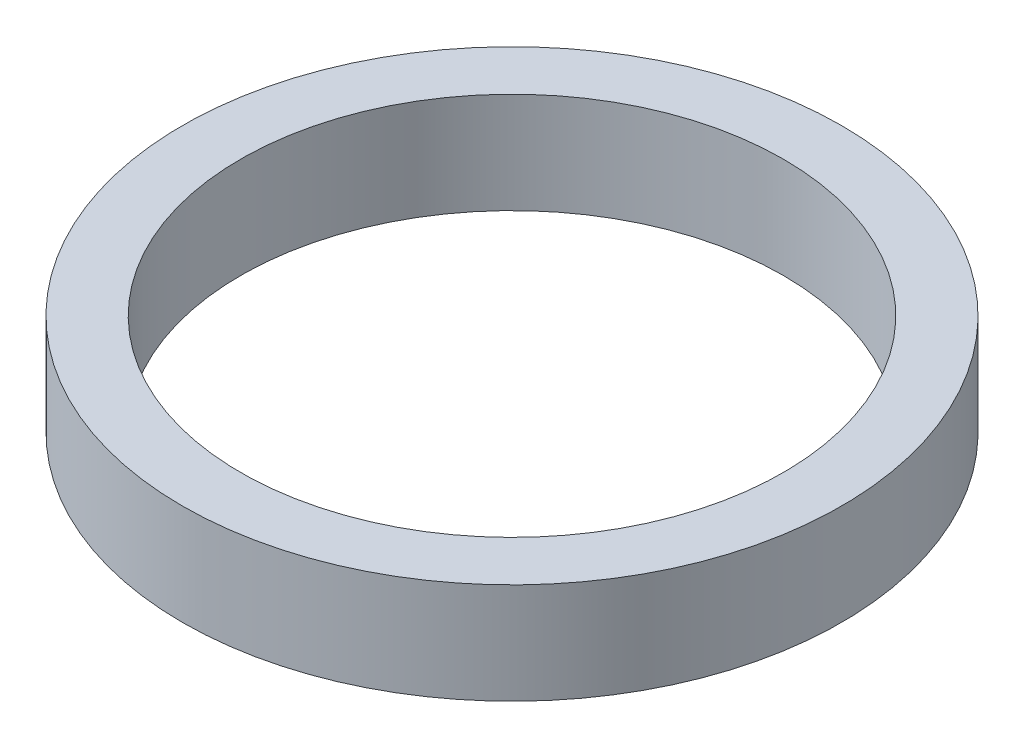
ISO-10303-21;
HEADER;
FILE_DESCRIPTION(('STEP AP214'),'2;1');
FILE_NAME('part.step','',(''),(''),'','','');
FILE_SCHEMA(('AUTOMOTIVE_DESIGN { 1 0 10303 214 1 1 1 1 }'));
ENDSEC;
DATA;
#1=APPLICATION_CONTEXT('core data for automotive mechanical design processes');
#2=APPLICATION_PROTOCOL_DEFINITION('international standard','automotive_design',2000,#1);
#3=PRODUCT_CONTEXT('',#1,'mechanical');
#4=PRODUCT('Part','Part','',(#3));
#5=PRODUCT_RELATED_PRODUCT_CATEGORY('part','',(#4));
#6=PRODUCT_DEFINITION_FORMATION('','',#4);
#7=PRODUCT_DEFINITION_CONTEXT('part definition',#1,'design');
#8=PRODUCT_DEFINITION('design','',#6,#7);
#9=PRODUCT_DEFINITION_SHAPE('','',#8);
#10=(LENGTH_UNIT() NAMED_UNIT(*) SI_UNIT(.MILLI.,.METRE.));
#11=(NAMED_UNIT(*) PLANE_ANGLE_UNIT() SI_UNIT($,.RADIAN.));
#12=(NAMED_UNIT(*) SI_UNIT($,.STERADIAN.) SOLID_ANGLE_UNIT());
#13=UNCERTAINTY_MEASURE_WITH_UNIT(LENGTH_MEASURE(1.E-05),#10,'distance_accuracy_value','');
#14=(GEOMETRIC_REPRESENTATION_CONTEXT(3) GLOBAL_UNCERTAINTY_ASSIGNED_CONTEXT((#13)) GLOBAL_UNIT_ASSIGNED_CONTEXT((#10,
#11,#12)) REPRESENTATION_CONTEXT('',''));
#15=CARTESIAN_POINT('',(0.,0.,0.));
#16=DIRECTION('',(0.,0.,1.));
#17=DIRECTION('',(1.,0.,0.));
#18=AXIS2_PLACEMENT_3D('',#15,#16,#17);
#19=CARTESIAN_POINT('',(0.,13.,0.));
#20=DIRECTION('',(0.,-1.,0.));
#21=DIRECTION('',(0.,0.,-1.));
#22=AXIS2_PLACEMENT_3D('',#19,#20,#21);
#23=CYLINDRICAL_SURFACE('',#22,42.5);
#24=CARTESIAN_POINT('',(0.,13.,0.));
#25=DIRECTION('',(0.,1.,0.));
#26=DIRECTION('',(0.,0.,1.));
#27=AXIS2_PLACEMENT_3D('',#24,#25,#26);
#28=CIRCLE('',#27,42.5);
#29=CARTESIAN_POINT('',(0.,13.,-42.5));
#30=VERTEX_POINT('',#29);
#31=EDGE_CURVE('E10',#30,#30,#28,.T.);
#32=CARTESIAN_POINT('',(0.,0.,0.));
#33=DIRECTION('',(0.,1.,0.));
#34=DIRECTION('',(0.,0.,1.));
#35=AXIS2_PLACEMENT_3D('',#32,#33,#34);
#36=CIRCLE('',#35,42.5);
#37=CARTESIAN_POINT('',(0.,0.,-42.5));
#38=VERTEX_POINT('',#37);
#39=EDGE_CURVE('E37',#38,#38,#36,.T.);
#40=CARTESIAN_POINT('',(0.,13.,-42.5));
#41=CARTESIAN_POINT('',(0.,12.8645833333333,-42.5));
#42=CARTESIAN_POINT('',(0.,12.7291666666667,-42.5));
#43=CARTESIAN_POINT('',(0.,12.4583333333333,-42.5));
#44=CARTESIAN_POINT('',(0.,12.3229166666667,-42.5));
#45=CARTESIAN_POINT('',(0.,12.0520833333333,-42.5));
#46=CARTESIAN_POINT('',(0.,11.9166666666667,-42.5));
#47=CARTESIAN_POINT('',(0.,11.6458333333333,-42.5));
#48=CARTESIAN_POINT('',(0.,11.5104166666667,-42.5));
#49=CARTESIAN_POINT('',(0.,11.2395833333333,-42.5));
#50=CARTESIAN_POINT('',(0.,11.1041666666667,-42.5));
#51=CARTESIAN_POINT('',(0.,10.8333333333333,-42.5));
#52=CARTESIAN_POINT('',(0.,10.6979166666667,-42.5));
#53=CARTESIAN_POINT('',(0.,10.4270833333333,-42.5));
#54=CARTESIAN_POINT('',(0.,10.2916666666667,-42.5));
#55=CARTESIAN_POINT('',(0.,10.0208333333333,-42.5));
#56=CARTESIAN_POINT('',(0.,9.88541666666667,-42.5));
#57=CARTESIAN_POINT('',(0.,9.61458333333333,-42.5));
#58=CARTESIAN_POINT('',(0.,9.47916666666667,-42.5));
#59=CARTESIAN_POINT('',(0.,9.20833333333333,-42.5));
#60=CARTESIAN_POINT('',(0.,9.07291666666666,-42.5));
#61=CARTESIAN_POINT('',(0.,8.80208333333333,-42.5));
#62=CARTESIAN_POINT('',(0.,8.66666666666667,-42.5));
#63=CARTESIAN_POINT('',(0.,8.39583333333333,-42.5));
#64=CARTESIAN_POINT('',(0.,8.26041666666667,-42.5));
#65=CARTESIAN_POINT('',(0.,7.98958333333333,-42.5));
#66=CARTESIAN_POINT('',(0.,7.85416666666667,-42.5));
#67=CARTESIAN_POINT('',(0.,7.58333333333333,-42.5));
#68=CARTESIAN_POINT('',(0.,7.44791666666667,-42.5));
#69=CARTESIAN_POINT('',(0.,7.17708333333333,-42.5));
#70=CARTESIAN_POINT('',(0.,7.04166666666667,-42.5));
#71=CARTESIAN_POINT('',(0.,6.77083333333333,-42.5));
#72=CARTESIAN_POINT('',(0.,6.63541666666667,-42.5));
#73=CARTESIAN_POINT('',(0.,6.36458333333333,-42.5));
#74=CARTESIAN_POINT('',(0.,6.22916666666667,-42.5));
#75=CARTESIAN_POINT('',(0.,5.95833333333333,-42.5));
#76=CARTESIAN_POINT('',(0.,5.82291666666667,-42.5));
#77=CARTESIAN_POINT('',(0.,5.55208333333333,-42.5));
#78=CARTESIAN_POINT('',(0.,5.41666666666667,-42.5));
#79=CARTESIAN_POINT('',(0.,5.14583333333333,-42.5));
#80=CARTESIAN_POINT('',(0.,5.01041666666667,-42.5));
#81=CARTESIAN_POINT('',(0.,4.73958333333333,-42.5));
#82=CARTESIAN_POINT('',(0.,4.60416666666667,-42.5));
#83=CARTESIAN_POINT('',(0.,4.33333333333333,-42.5));
#84=CARTESIAN_POINT('',(0.,4.19791666666667,-42.5));
#85=CARTESIAN_POINT('',(0.,3.92708333333333,-42.5));
#86=CARTESIAN_POINT('',(0.,3.79166666666667,-42.5));
#87=CARTESIAN_POINT('',(0.,3.52083333333333,-42.5));
#88=CARTESIAN_POINT('',(0.,3.38541666666667,-42.5));
#89=CARTESIAN_POINT('',(0.,3.11458333333333,-42.5));
#90=CARTESIAN_POINT('',(0.,2.97916666666667,-42.5));
#91=CARTESIAN_POINT('',(0.,2.70833333333333,-42.5));
#92=CARTESIAN_POINT('',(0.,2.57291666666667,-42.5));
#93=CARTESIAN_POINT('',(0.,2.30208333333333,-42.5));
#94=CARTESIAN_POINT('',(0.,2.16666666666667,-42.5));
#95=CARTESIAN_POINT('',(0.,1.89583333333333,-42.5));
#96=CARTESIAN_POINT('',(0.,1.76041666666667,-42.5));
#97=CARTESIAN_POINT('',(0.,1.48958333333333,-42.5));
#98=CARTESIAN_POINT('',(0.,1.35416666666667,-42.5));
#99=CARTESIAN_POINT('',(0.,1.08333333333333,-42.5));
#100=CARTESIAN_POINT('',(0.,0.947916666666667,-42.5));
#101=CARTESIAN_POINT('',(0.,0.677083333333334,-42.5));
#102=CARTESIAN_POINT('',(0.,0.541666666666667,-42.5));
#103=CARTESIAN_POINT('',(0.,0.270833333333334,-42.5));
#104=CARTESIAN_POINT('',(0.,0.135416666666667,-42.5));
#105=CARTESIAN_POINT('',(0.,0.,-42.5));
#106=B_SPLINE_CURVE_WITH_KNOTS('',3,(#40,#41,#42,#43,#44,#45,#46,#47,#48,#49,#50,#51,#52,#53,
#54,#55,#56,#57,#58,#59,#60,#61,#62,#63,#64,#65,#66,#67,#68,#69,#70,#71,#72,#73,#74,#75,#76,#77,
#78,#79,#80,#81,#82,#83,#84,#85,#86,#87,#88,#89,#90,#91,#92,#93,#94,#95,#96,#97,#98,#99,#100,
#101,#102,#103,#104,#105),.UNSPECIFIED.,.F.,.F.,(4,2,2,2,2,2,2,2,2,2,2,2,2,2,2,2,2,2,2,2,2,2,2,
2,2,2,2,2,2,2,2,2,4),(0.,0.40625,0.812500000000001,1.21875,1.625,2.03125,2.4375,2.84375,3.25,
3.65625,4.0625,4.46875,4.875,5.28125,5.6875,6.09375,6.5,6.90625,7.3125,7.71875,8.125,8.53125,
8.9375,9.34375,9.75,10.15625,10.5625,10.96875,11.375,11.78125,12.1875,12.59375,13.),.UNSPECIFIED.);
#107=EDGE_CURVE('BSEAM40',#30,#38,#106,.T.);
#108=ORIENTED_EDGE('',*,*,#31,.F.);
#109=ORIENTED_EDGE('',*,*,#39,.T.);
#110=ORIENTED_EDGE('',*,*,#107,.T.);
#111=ORIENTED_EDGE('',*,*,#107,.F.);
#112=EDGE_LOOP('',(#108,#110,#109,#111));
#113=FACE_BOUND('',#112,.T.);
#114=ADVANCED_FACE('F40',(#113),#23,.T.);
#115=CARTESIAN_POINT('',(0.,13.,0.));
#116=DIRECTION('',(0.,1.,0.));
#117=DIRECTION('',(0.,0.,1.));
#118=AXIS2_PLACEMENT_3D('',#115,#116,#117);
#119=PLANE('',#118);
#120=CARTESIAN_POINT('',(0.,13.,0.));
#121=DIRECTION('',(0.,1.,0.));
#122=DIRECTION('',(0.,0.,1.));
#123=AXIS2_PLACEMENT_3D('',#120,#121,#122);
#124=CIRCLE('',#123,35.);
#125=CARTESIAN_POINT('',(0.,13.,-35.));
#126=VERTEX_POINT('',#125);
#127=EDGE_CURVE('E50',#126,#126,#124,.T.);
#128=ORIENTED_EDGE('',*,*,#127,.F.);
#129=EDGE_LOOP('',(#128));
#130=FACE_BOUND('',#129,.T.);
#131=ORIENTED_EDGE('',*,*,#31,.T.);
#132=EDGE_LOOP('',(#131));
#133=FACE_BOUND('',#132,.T.);
#134=ADVANCED_FACE('F59',(#130,#133),#119,.T.);
#135=CARTESIAN_POINT('',(0.,0.,0.));
#136=DIRECTION('',(0.,1.,0.));
#137=DIRECTION('',(0.,0.,1.));
#138=AXIS2_PLACEMENT_3D('',#135,#136,#137);
#139=PLANE('',#138);
#140=CARTESIAN_POINT('',(0.,0.,0.));
#141=DIRECTION('',(0.,1.,0.));
#142=DIRECTION('',(0.,0.,1.));
#143=AXIS2_PLACEMENT_3D('',#140,#141,#142);
#144=CIRCLE('',#143,35.);
#145=CARTESIAN_POINT('',(0.,0.,-35.));
#146=VERTEX_POINT('',#145);
#147=EDGE_CURVE('E47',#146,#146,#144,.T.);
#148=ORIENTED_EDGE('',*,*,#147,.T.);
#149=EDGE_LOOP('',(#148));
#150=FACE_BOUND('',#149,.T.);
#151=ORIENTED_EDGE('',*,*,#39,.F.);
#152=EDGE_LOOP('',(#151));
#153=FACE_BOUND('',#152,.T.);
#154=ADVANCED_FACE('F58',(#150,#153),#139,.F.);
#155=CARTESIAN_POINT('',(0.,13.,0.));
#156=DIRECTION('',(0.,-1.,0.));
#157=DIRECTION('',(0.,0.,-1.));
#158=AXIS2_PLACEMENT_3D('',#155,#156,#157);
#159=CYLINDRICAL_SURFACE('',#158,35.);
#160=CARTESIAN_POINT('',(0.,13.,-35.));
#161=CARTESIAN_POINT('',(0.,12.8645833333333,-35.));
#162=CARTESIAN_POINT('',(0.,12.7291666666667,-35.));
#163=CARTESIAN_POINT('',(0.,12.4583333333333,-35.));
#164=CARTESIAN_POINT('',(0.,12.3229166666667,-35.));
#165=CARTESIAN_POINT('',(0.,12.0520833333333,-35.));
#166=CARTESIAN_POINT('',(0.,11.9166666666667,-35.));
#167=CARTESIAN_POINT('',(0.,11.6458333333333,-35.));
#168=CARTESIAN_POINT('',(0.,11.5104166666667,-35.));
#169=CARTESIAN_POINT('',(0.,11.2395833333333,-35.));
#170=CARTESIAN_POINT('',(0.,11.1041666666667,-35.));
#171=CARTESIAN_POINT('',(0.,10.8333333333333,-35.));
#172=CARTESIAN_POINT('',(0.,10.6979166666667,-35.));
#173=CARTESIAN_POINT('',(0.,10.4270833333333,-35.));
#174=CARTESIAN_POINT('',(0.,10.2916666666667,-35.));
#175=CARTESIAN_POINT('',(0.,10.0208333333333,-35.));
#176=CARTESIAN_POINT('',(0.,9.88541666666667,-35.));
#177=CARTESIAN_POINT('',(0.,9.61458333333333,-35.));
#178=CARTESIAN_POINT('',(0.,9.47916666666667,-35.));
#179=CARTESIAN_POINT('',(0.,9.20833333333333,-35.));
#180=CARTESIAN_POINT('',(0.,9.07291666666666,-35.));
#181=CARTESIAN_POINT('',(0.,8.80208333333333,-35.));
#182=CARTESIAN_POINT('',(0.,8.66666666666667,-35.));
#183=CARTESIAN_POINT('',(0.,8.39583333333333,-35.));
#184=CARTESIAN_POINT('',(0.,8.26041666666667,-35.));
#185=CARTESIAN_POINT('',(0.,7.98958333333333,-35.));
#186=CARTESIAN_POINT('',(0.,7.85416666666667,-35.));
#187=CARTESIAN_POINT('',(0.,7.58333333333333,-35.));
#188=CARTESIAN_POINT('',(0.,7.44791666666667,-35.));
#189=CARTESIAN_POINT('',(0.,7.17708333333333,-35.));
#190=CARTESIAN_POINT('',(0.,7.04166666666667,-35.));
#191=CARTESIAN_POINT('',(0.,6.77083333333333,-35.));
#192=CARTESIAN_POINT('',(0.,6.63541666666667,-35.));
#193=CARTESIAN_POINT('',(0.,6.36458333333333,-35.));
#194=CARTESIAN_POINT('',(0.,6.22916666666667,-35.));
#195=CARTESIAN_POINT('',(0.,5.95833333333333,-35.));
#196=CARTESIAN_POINT('',(0.,5.82291666666667,-35.));
#197=CARTESIAN_POINT('',(0.,5.55208333333333,-35.));
#198=CARTESIAN_POINT('',(0.,5.41666666666667,-35.));
#199=CARTESIAN_POINT('',(0.,5.14583333333333,-35.));
#200=CARTESIAN_POINT('',(0.,5.01041666666667,-35.));
#201=CARTESIAN_POINT('',(0.,4.73958333333333,-35.));
#202=CARTESIAN_POINT('',(0.,4.60416666666667,-35.));
#203=CARTESIAN_POINT('',(0.,4.33333333333333,-35.));
#204=CARTESIAN_POINT('',(0.,4.19791666666667,-35.));
#205=CARTESIAN_POINT('',(0.,3.92708333333333,-35.));
#206=CARTESIAN_POINT('',(0.,3.79166666666667,-35.));
#207=CARTESIAN_POINT('',(0.,3.52083333333333,-35.));
#208=CARTESIAN_POINT('',(0.,3.38541666666667,-35.));
#209=CARTESIAN_POINT('',(0.,3.11458333333333,-35.));
#210=CARTESIAN_POINT('',(0.,2.97916666666667,-35.));
#211=CARTESIAN_POINT('',(0.,2.70833333333333,-35.));
#212=CARTESIAN_POINT('',(0.,2.57291666666667,-35.));
#213=CARTESIAN_POINT('',(0.,2.30208333333333,-35.));
#214=CARTESIAN_POINT('',(0.,2.16666666666667,-35.));
#215=CARTESIAN_POINT('',(0.,1.89583333333333,-35.));
#216=CARTESIAN_POINT('',(0.,1.76041666666667,-35.));
#217=CARTESIAN_POINT('',(0.,1.48958333333333,-35.));
#218=CARTESIAN_POINT('',(0.,1.35416666666667,-35.));
#219=CARTESIAN_POINT('',(0.,1.08333333333333,-35.));
#220=CARTESIAN_POINT('',(0.,0.947916666666667,-35.));
#221=CARTESIAN_POINT('',(0.,0.677083333333334,-35.));
#222=CARTESIAN_POINT('',(0.,0.541666666666667,-35.));
#223=CARTESIAN_POINT('',(0.,0.270833333333334,-35.));
#224=CARTESIAN_POINT('',(0.,0.135416666666667,-35.));
#225=CARTESIAN_POINT('',(0.,0.,-35.));
#226=B_SPLINE_CURVE_WITH_KNOTS('',3,(#160,#161,#162,#163,#164,#165,#166,#167,#168,#169,#170,
#171,#172,#173,#174,#175,#176,#177,#178,#179,#180,#181,#182,#183,#184,#185,#186,#187,#188,#189,
#190,#191,#192,#193,#194,#195,#196,#197,#198,#199,#200,#201,#202,#203,#204,#205,#206,#207,#208,
#209,#210,#211,#212,#213,#214,#215,#216,#217,#218,#219,#220,#221,#222,#223,#224,#225),
.UNSPECIFIED.,.F.,.F.,(4,2,2,2,2,2,2,2,2,2,2,2,2,2,2,2,2,2,2,2,2,2,2,2,2,2,2,2,2,2,2,2,4),(0.,
0.40625,0.812500000000001,1.21875,1.625,2.03125,2.4375,2.84375,3.25,3.65625,4.0625,4.46875,
4.875,5.28125,5.6875,6.09375,6.5,6.90625,7.3125,7.71875,8.125,8.53125,8.9375,9.34375,9.75,
10.15625,10.5625,10.96875,11.375,11.78125,12.1875,12.59375,13.),.UNSPECIFIED.);
#227=EDGE_CURVE('BSEAM54',#126,#146,#226,.T.);
#228=ORIENTED_EDGE('',*,*,#127,.T.);
#229=ORIENTED_EDGE('',*,*,#147,.F.);
#230=ORIENTED_EDGE('',*,*,#227,.T.);
#231=ORIENTED_EDGE('',*,*,#227,.F.);
#232=EDGE_LOOP('',(#228,#230,#229,#231));
#233=FACE_BOUND('',#232,.T.);
#234=ADVANCED_FACE('F54',(#233),#159,.F.);
#235=CLOSED_SHELL('',(#114,#134,#154,#234));
#236=MANIFOLD_SOLID_BREP('B2',#235);
#237=ADVANCED_BREP_SHAPE_REPRESENTATION('',(#18,#236),#14);
#238=SHAPE_DEFINITION_REPRESENTATION(#9,#237);
ENDSEC;
END-ISO-10303-21;
